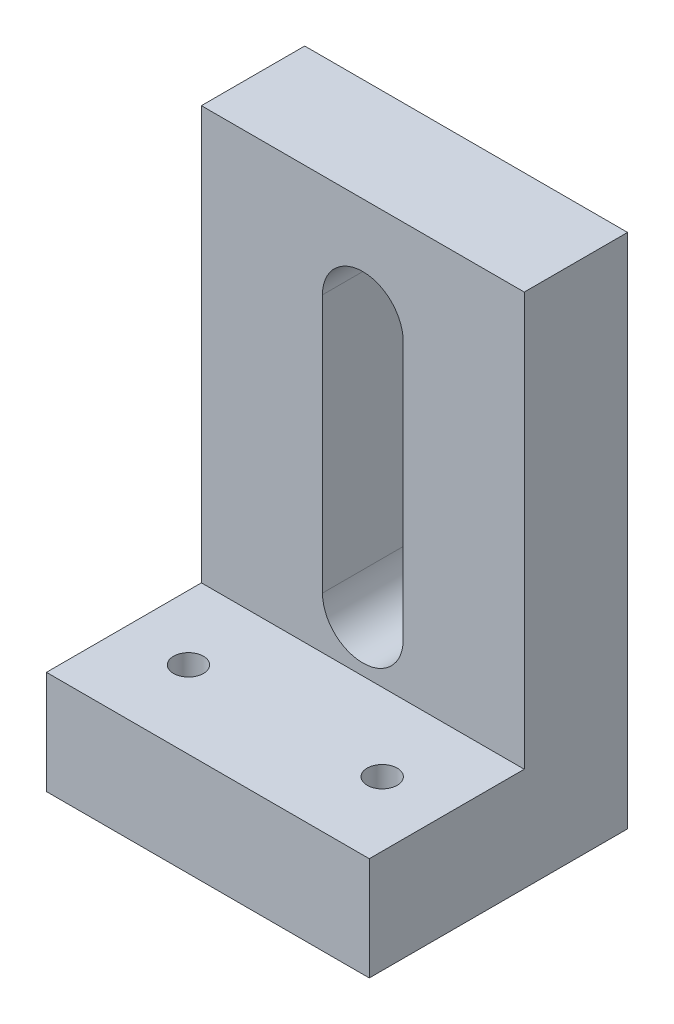
ISO-10303-21;
HEADER;
FILE_DESCRIPTION(('STEP AP214'),'2;1');
FILE_NAME('part.step','',(''),(''),'','','');
FILE_SCHEMA(('AUTOMOTIVE_DESIGN { 1 0 10303 214 1 1 1 1 }'));
ENDSEC;
DATA;
#1=APPLICATION_CONTEXT('core data for automotive mechanical design processes');
#2=APPLICATION_PROTOCOL_DEFINITION('international standard','automotive_design',2000,#1);
#3=PRODUCT_CONTEXT('',#1,'mechanical');
#4=PRODUCT('Part','Part','',(#3));
#5=PRODUCT_RELATED_PRODUCT_CATEGORY('part','',(#4));
#6=PRODUCT_DEFINITION_FORMATION('','',#4);
#7=PRODUCT_DEFINITION_CONTEXT('part definition',#1,'design');
#8=PRODUCT_DEFINITION('design','',#6,#7);
#9=PRODUCT_DEFINITION_SHAPE('','',#8);
#10=(LENGTH_UNIT() NAMED_UNIT(*) SI_UNIT(.MILLI.,.METRE.));
#11=(NAMED_UNIT(*) PLANE_ANGLE_UNIT() SI_UNIT($,.RADIAN.));
#12=(NAMED_UNIT(*) SI_UNIT($,.STERADIAN.) SOLID_ANGLE_UNIT());
#13=UNCERTAINTY_MEASURE_WITH_UNIT(LENGTH_MEASURE(1.E-05),#10,'distance_accuracy_value','');
#14=(GEOMETRIC_REPRESENTATION_CONTEXT(3) GLOBAL_UNCERTAINTY_ASSIGNED_CONTEXT((#13)) GLOBAL_UNIT_ASSIGNED_CONTEXT((#10,
#11,#12)) REPRESENTATION_CONTEXT('',''));
#15=CARTESIAN_POINT('',(0.,0.,0.));
#16=DIRECTION('',(0.,0.,1.));
#17=DIRECTION('',(1.,0.,0.));
#18=AXIS2_PLACEMENT_3D('',#15,#16,#17);
#19=CARTESIAN_POINT('',(-31.75,50.8,-15.24));
#20=DIRECTION('',(0.,0.,1.));
#21=DIRECTION('',(0.,-1.,0.));
#22=AXIS2_PLACEMENT_3D('',#19,#20,#21);
#23=PLANE('',#22);
#24=DIRECTION('',(0.,-1.,0.));
#25=VECTOR('',#24,1.);
#26=CARTESIAN_POINT('',(0.,50.8,-15.24));
#27=LINE('',#26,#25);
#28=CARTESIAN_POINT('',(0.,50.8,-15.24));
#29=VERTEX_POINT('',#28);
#30=CARTESIAN_POINT('',(0.,10.16,-15.24));
#31=VERTEX_POINT('',#30);
#32=EDGE_CURVE('E180',#29,#31,#27,.T.);
#33=ORIENTED_EDGE('',*,*,#32,.F.);
#34=DIRECTION('',(1.,0.,0.));
#35=VECTOR('',#34,1.);
#36=CARTESIAN_POINT('',(-31.75,50.8,-15.24));
#37=LINE('',#36,#35);
#38=CARTESIAN_POINT('',(-31.75,50.8,-15.24));
#39=VERTEX_POINT('',#38);
#40=EDGE_CURVE('E186',#39,#29,#37,.T.);
#41=ORIENTED_EDGE('',*,*,#40,.F.);
#42=DIRECTION('',(0.,-1.,0.));
#43=VECTOR('',#42,1.);
#44=CARTESIAN_POINT('',(-31.75,50.8,-15.24));
#45=LINE('',#44,#43);
#46=CARTESIAN_POINT('',(-31.75,10.16,-15.24));
#47=VERTEX_POINT('',#46);
#48=EDGE_CURVE('E163',#39,#47,#45,.T.);
#49=ORIENTED_EDGE('',*,*,#48,.T.);
#50=DIRECTION('',(1.,0.,0.));
#51=VECTOR('',#50,1.);
#52=CARTESIAN_POINT('',(-31.75,10.16,-15.24));
#53=LINE('',#52,#51);
#54=EDGE_CURVE('E41',#47,#31,#53,.T.);
#55=ORIENTED_EDGE('',*,*,#54,.T.);
#56=EDGE_LOOP('',(#33,#41,#49,#55));
#57=FACE_BOUND('',#56,.T.);
#58=CARTESIAN_POINT('',(-15.875,40.64,-15.24));
#59=DIRECTION('',(0.,0.,1.));
#60=DIRECTION('',(1.,0.,0.));
#61=AXIS2_PLACEMENT_3D('',#58,#59,#60);
#62=CIRCLE('',#61,3.96875);
#63=CARTESIAN_POINT('',(-11.90625,40.64,-15.24));
#64=VERTEX_POINT('',#63);
#65=CARTESIAN_POINT('',(-19.84375,40.64,-15.24));
#66=VERTEX_POINT('',#65);
#67=EDGE_CURVE('E139',#64,#66,#62,.T.);
#68=ORIENTED_EDGE('',*,*,#67,.F.);
#69=DIRECTION('',(0.,-1.,0.));
#70=VECTOR('',#69,1.);
#71=CARTESIAN_POINT('',(-11.90625,0.,-15.24));
#72=LINE('',#71,#70);
#73=CARTESIAN_POINT('',(-11.90625,15.24,-15.24));
#74=VERTEX_POINT('',#73);
#75=EDGE_CURVE('E49',#64,#74,#72,.T.);
#76=ORIENTED_EDGE('',*,*,#75,.T.);
#77=CARTESIAN_POINT('',(-15.875,15.24,-15.24));
#78=DIRECTION('',(0.,0.,1.));
#79=DIRECTION('',(1.,0.,0.));
#80=AXIS2_PLACEMENT_3D('',#77,#78,#79);
#81=CIRCLE('',#80,3.96875);
#82=CARTESIAN_POINT('',(-19.84375,15.24,-15.24));
#83=VERTEX_POINT('',#82);
#84=EDGE_CURVE('E127',#83,#74,#81,.T.);
#85=ORIENTED_EDGE('',*,*,#84,.F.);
#86=DIRECTION('',(0.,-1.,0.));
#87=VECTOR('',#86,1.);
#88=CARTESIAN_POINT('',(-19.84375,0.,-15.24));
#89=LINE('',#88,#87);
#90=EDGE_CURVE('E130',#66,#83,#89,.T.);
#91=ORIENTED_EDGE('',*,*,#90,.F.);
#92=EDGE_LOOP('',(#68,#76,#85,#91));
#93=FACE_BOUND('',#92,.T.);
#94=ADVANCED_FACE('F32',(#57,#93),#23,.T.);
#95=CARTESIAN_POINT('',(-31.75,0.,-25.4));
#96=DIRECTION('',(0.,0.,-1.));
#97=DIRECTION('',(-1.,0.,0.));
#98=AXIS2_PLACEMENT_3D('',#95,#96,#97);
#99=PLANE('',#98);
#100=DIRECTION('',(0.,1.,0.));
#101=VECTOR('',#100,1.);
#102=CARTESIAN_POINT('',(0.,0.,-25.4));
#103=LINE('',#102,#101);
#104=CARTESIAN_POINT('',(0.,0.,-25.4));
#105=VERTEX_POINT('',#104);
#106=CARTESIAN_POINT('',(0.,50.8,-25.4));
#107=VERTEX_POINT('',#106);
#108=EDGE_CURVE('E174',#105,#107,#103,.T.);
#109=ORIENTED_EDGE('',*,*,#108,.F.);
#110=DIRECTION('',(1.,0.,0.));
#111=VECTOR('',#110,1.);
#112=CARTESIAN_POINT('',(-31.75,0.,-25.4));
#113=LINE('',#112,#111);
#114=CARTESIAN_POINT('',(-31.75,0.,-25.4));
#115=VERTEX_POINT('',#114);
#116=EDGE_CURVE('E189',#115,#105,#113,.T.);
#117=ORIENTED_EDGE('',*,*,#116,.F.);
#118=DIRECTION('',(0.,1.,0.));
#119=VECTOR('',#118,1.);
#120=CARTESIAN_POINT('',(-31.75,0.,-25.4));
#121=LINE('',#120,#119);
#122=CARTESIAN_POINT('',(-31.75,50.8,-25.4));
#123=VERTEX_POINT('',#122);
#124=EDGE_CURVE('E157',#115,#123,#121,.T.);
#125=ORIENTED_EDGE('',*,*,#124,.T.);
#126=DIRECTION('',(1.,0.,0.));
#127=VECTOR('',#126,1.);
#128=CARTESIAN_POINT('',(-31.75,50.8,-25.4));
#129=LINE('',#128,#127);
#130=EDGE_CURVE('E188',#123,#107,#129,.T.);
#131=ORIENTED_EDGE('',*,*,#130,.T.);
#132=EDGE_LOOP('',(#109,#117,#125,#131));
#133=FACE_BOUND('',#132,.T.);
#134=CARTESIAN_POINT('',(-15.875,15.24,-25.4));
#135=DIRECTION('',(0.,0.,1.));
#136=DIRECTION('',(1.,0.,0.));
#137=AXIS2_PLACEMENT_3D('',#134,#135,#136);
#138=CIRCLE('',#137,3.96875);
#139=CARTESIAN_POINT('',(-19.84375,15.24,-25.4));
#140=VERTEX_POINT('',#139);
#141=CARTESIAN_POINT('',(-11.90625,15.24,-25.4));
#142=VERTEX_POINT('',#141);
#143=EDGE_CURVE('E117',#140,#142,#138,.T.);
#144=ORIENTED_EDGE('',*,*,#143,.T.);
#145=DIRECTION('',(0.,-1.,0.));
#146=VECTOR('',#145,1.);
#147=CARTESIAN_POINT('',(-11.90625,0.,-25.4));
#148=LINE('',#147,#146);
#149=CARTESIAN_POINT('',(-11.90625,40.64,-25.4));
#150=VERTEX_POINT('',#149);
#151=EDGE_CURVE('E111',#150,#142,#148,.T.);
#152=ORIENTED_EDGE('',*,*,#151,.F.);
#153=CARTESIAN_POINT('',(-15.875,40.64,-25.4));
#154=DIRECTION('',(0.,0.,1.));
#155=DIRECTION('',(1.,0.,0.));
#156=AXIS2_PLACEMENT_3D('',#153,#154,#155);
#157=CIRCLE('',#156,3.96875);
#158=CARTESIAN_POINT('',(-19.84375,40.64,-25.4));
#159=VERTEX_POINT('',#158);
#160=EDGE_CURVE('E120',#150,#159,#157,.T.);
#161=ORIENTED_EDGE('',*,*,#160,.T.);
#162=DIRECTION('',(0.,-1.,0.));
#163=VECTOR('',#162,1.);
#164=CARTESIAN_POINT('',(-19.84375,0.,-25.4));
#165=LINE('',#164,#163);
#166=EDGE_CURVE('E57',#159,#140,#165,.T.);
#167=ORIENTED_EDGE('',*,*,#166,.T.);
#168=EDGE_LOOP('',(#144,#152,#161,#167));
#169=FACE_BOUND('',#168,.T.);
#170=ADVANCED_FACE('F125',(#133,#169),#99,.T.);
#171=CARTESIAN_POINT('',(-31.75,10.16,0.));
#172=DIRECTION('',(0.,0.,1.));
#173=DIRECTION('',(1.,0.,0.));
#174=AXIS2_PLACEMENT_3D('',#171,#172,#173);
#175=PLANE('',#174);
#176=DIRECTION('',(0.,-1.,0.));
#177=VECTOR('',#176,1.);
#178=CARTESIAN_POINT('',(0.,10.16,0.));
#179=LINE('',#178,#177);
#180=CARTESIAN_POINT('',(0.,10.16,0.));
#181=VERTEX_POINT('',#180);
#182=CARTESIAN_POINT('',(0.,0.,0.));
#183=VERTEX_POINT('',#182);
#184=EDGE_CURVE('E146',#181,#183,#179,.T.);
#185=ORIENTED_EDGE('',*,*,#184,.F.);
#186=DIRECTION('',(1.,0.,0.));
#187=VECTOR('',#186,1.);
#188=CARTESIAN_POINT('',(-31.75,10.16,0.));
#189=LINE('',#188,#187);
#190=CARTESIAN_POINT('',(-31.75,10.16,0.));
#191=VERTEX_POINT('',#190);
#192=EDGE_CURVE('E11',#191,#181,#189,.T.);
#193=ORIENTED_EDGE('',*,*,#192,.F.);
#194=DIRECTION('',(0.,-1.,0.));
#195=VECTOR('',#194,1.);
#196=CARTESIAN_POINT('',(-31.75,10.16,0.));
#197=LINE('',#196,#195);
#198=CARTESIAN_POINT('',(-31.75,0.,0.));
#199=VERTEX_POINT('',#198);
#200=EDGE_CURVE('E150',#191,#199,#197,.T.);
#201=ORIENTED_EDGE('',*,*,#200,.T.);
#202=DIRECTION('',(1.,0.,0.));
#203=VECTOR('',#202,1.);
#204=CARTESIAN_POINT('',(-31.75,0.,0.));
#205=LINE('',#204,#203);
#206=EDGE_CURVE('E36',#199,#183,#205,.T.);
#207=ORIENTED_EDGE('',*,*,#206,.T.);
#208=EDGE_LOOP('',(#185,#193,#201,#207));
#209=FACE_BOUND('',#208,.T.);
#210=ADVANCED_FACE('F34',(#209),#175,.T.);
#211=CARTESIAN_POINT('',(-31.75,10.16,-15.24));
#212=DIRECTION('',(0.,1.,0.));
#213=DIRECTION('',(0.,0.,1.));
#214=AXIS2_PLACEMENT_3D('',#211,#212,#213);
#215=PLANE('',#214);
#216=CARTESIAN_POINT('',(-25.4,10.16,-7.62));
#217=DIRECTION('',(0.,1.,0.));
#218=DIRECTION('',(0.,0.,1.));
#219=AXIS2_PLACEMENT_3D('',#216,#217,#218);
#220=CIRCLE('',#219,1.4732);
#221=CARTESIAN_POINT('',(-25.4,10.16,-6.1468));
#222=VERTEX_POINT('',#221);
#223=EDGE_CURVE('E258',#222,#222,#220,.T.);
#224=ORIENTED_EDGE('',*,*,#223,.F.);
#225=EDGE_LOOP('',(#224));
#226=FACE_BOUND('',#225,.T.);
#227=CARTESIAN_POINT('',(-6.35,10.16,-7.62));
#228=DIRECTION('',(0.,1.,0.));
#229=DIRECTION('',(0.,0.,1.));
#230=AXIS2_PLACEMENT_3D('',#227,#228,#229);
#231=CIRCLE('',#230,1.4732);
#232=CARTESIAN_POINT('',(-6.35,10.16,-6.1468));
#233=VERTEX_POINT('',#232);
#234=EDGE_CURVE('E133',#233,#233,#231,.T.);
#235=ORIENTED_EDGE('',*,*,#234,.F.);
#236=EDGE_LOOP('',(#235));
#237=FACE_BOUND('',#236,.T.);
#238=DIRECTION('',(0.,0.,1.));
#239=VECTOR('',#238,1.);
#240=CARTESIAN_POINT('',(0.,10.16,-15.24));
#241=LINE('',#240,#239);
#242=EDGE_CURVE('E154',#31,#181,#241,.T.);
#243=ORIENTED_EDGE('',*,*,#242,.F.);
#244=ORIENTED_EDGE('',*,*,#54,.F.);
#245=DIRECTION('',(0.,0.,1.));
#246=VECTOR('',#245,1.);
#247=CARTESIAN_POINT('',(-31.75,10.16,-15.24));
#248=LINE('',#247,#246);
#249=EDGE_CURVE('E166',#47,#191,#248,.T.);
#250=ORIENTED_EDGE('',*,*,#249,.T.);
#251=ORIENTED_EDGE('',*,*,#192,.T.);
#252=EDGE_LOOP('',(#243,#244,#250,#251));
#253=FACE_BOUND('',#252,.T.);
#254=ADVANCED_FACE('F203',(#226,#237,#253),#215,.T.);
#255=CARTESIAN_POINT('',(-31.75,50.8,-25.4));
#256=DIRECTION('',(0.,1.,0.));
#257=DIRECTION('',(0.,0.,1.));
#258=AXIS2_PLACEMENT_3D('',#255,#256,#257);
#259=PLANE('',#258);
#260=DIRECTION('',(0.,0.,1.));
#261=VECTOR('',#260,1.);
#262=CARTESIAN_POINT('',(0.,50.8,-25.4));
#263=LINE('',#262,#261);
#264=EDGE_CURVE('E177',#107,#29,#263,.T.);
#265=ORIENTED_EDGE('',*,*,#264,.F.);
#266=ORIENTED_EDGE('',*,*,#130,.F.);
#267=DIRECTION('',(0.,0.,1.));
#268=VECTOR('',#267,1.);
#269=CARTESIAN_POINT('',(-31.75,50.8,-25.4));
#270=LINE('',#269,#268);
#271=EDGE_CURVE('E160',#123,#39,#270,.T.);
#272=ORIENTED_EDGE('',*,*,#271,.T.);
#273=ORIENTED_EDGE('',*,*,#40,.T.);
#274=EDGE_LOOP('',(#265,#266,#272,#273));
#275=FACE_BOUND('',#274,.T.);
#276=ADVANCED_FACE('F213',(#275),#259,.T.);
#277=CARTESIAN_POINT('',(-31.75,0.,0.));
#278=DIRECTION('',(0.,-1.,0.));
#279=DIRECTION('',(0.,0.,-1.));
#280=AXIS2_PLACEMENT_3D('',#277,#278,#279);
#281=PLANE('',#280);
#282=CARTESIAN_POINT('',(-25.4,0.,-7.62));
#283=DIRECTION('',(0.,1.,0.));
#284=DIRECTION('',(0.,0.,1.));
#285=AXIS2_PLACEMENT_3D('',#282,#283,#284);
#286=CIRCLE('',#285,1.4732);
#287=CARTESIAN_POINT('',(-25.4,0.,-6.1468));
#288=VERTEX_POINT('',#287);
#289=EDGE_CURVE('E140',#288,#288,#286,.T.);
#290=ORIENTED_EDGE('',*,*,#289,.T.);
#291=EDGE_LOOP('',(#290));
#292=FACE_BOUND('',#291,.T.);
#293=CARTESIAN_POINT('',(-6.35,0.,-7.62));
#294=DIRECTION('',(0.,1.,0.));
#295=DIRECTION('',(0.,0.,1.));
#296=AXIS2_PLACEMENT_3D('',#293,#294,#295);
#297=CIRCLE('',#296,1.4732);
#298=CARTESIAN_POINT('',(-6.35,0.,-6.1468));
#299=VERTEX_POINT('',#298);
#300=EDGE_CURVE('E256',#299,#299,#297,.T.);
#301=ORIENTED_EDGE('',*,*,#300,.T.);
#302=EDGE_LOOP('',(#301));
#303=FACE_BOUND('',#302,.T.);
#304=DIRECTION('',(0.,0.,-1.));
#305=VECTOR('',#304,1.);
#306=CARTESIAN_POINT('',(0.,0.,0.));
#307=LINE('',#306,#305);
#308=EDGE_CURVE('E171',#183,#105,#307,.T.);
#309=ORIENTED_EDGE('',*,*,#308,.F.);
#310=ORIENTED_EDGE('',*,*,#206,.F.);
#311=DIRECTION('',(0.,0.,-1.));
#312=VECTOR('',#311,1.);
#313=CARTESIAN_POINT('',(-31.75,0.,0.));
#314=LINE('',#313,#312);
#315=EDGE_CURVE('E153',#199,#115,#314,.T.);
#316=ORIENTED_EDGE('',*,*,#315,.T.);
#317=ORIENTED_EDGE('',*,*,#116,.T.);
#318=EDGE_LOOP('',(#309,#310,#316,#317));
#319=FACE_BOUND('',#318,.T.);
#320=ADVANCED_FACE('F197',(#292,#303,#319),#281,.T.);
#321=CARTESIAN_POINT('',(-31.75,0.,0.));
#322=DIRECTION('',(1.,0.,0.));
#323=DIRECTION('',(0.,0.,-1.));
#324=AXIS2_PLACEMENT_3D('',#321,#322,#323);
#325=PLANE('',#324);
#326=ORIENTED_EDGE('',*,*,#200,.F.);
#327=ORIENTED_EDGE('',*,*,#249,.F.);
#328=ORIENTED_EDGE('',*,*,#48,.F.);
#329=ORIENTED_EDGE('',*,*,#271,.F.);
#330=ORIENTED_EDGE('',*,*,#124,.F.);
#331=ORIENTED_EDGE('',*,*,#315,.F.);
#332=EDGE_LOOP('',(#326,#327,#328,#329,#330,#331));
#333=FACE_BOUND('',#332,.T.);
#334=ADVANCED_FACE('F206',(#333),#325,.F.);
#335=CARTESIAN_POINT('',(0.,0.,0.));
#336=DIRECTION('',(1.,0.,0.));
#337=DIRECTION('',(0.,0.,-1.));
#338=AXIS2_PLACEMENT_3D('',#335,#336,#337);
#339=PLANE('',#338);
#340=ORIENTED_EDGE('',*,*,#184,.T.);
#341=ORIENTED_EDGE('',*,*,#308,.T.);
#342=ORIENTED_EDGE('',*,*,#108,.T.);
#343=ORIENTED_EDGE('',*,*,#264,.T.);
#344=ORIENTED_EDGE('',*,*,#32,.T.);
#345=ORIENTED_EDGE('',*,*,#242,.T.);
#346=EDGE_LOOP('',(#340,#341,#342,#343,#344,#345));
#347=FACE_BOUND('',#346,.T.);
#348=ADVANCED_FACE('F199',(#347),#339,.T.);
#349=CARTESIAN_POINT('',(-11.90625,0.,-25.4));
#350=DIRECTION('',(-1.,0.,0.));
#351=DIRECTION('',(0.,-1.,0.));
#352=AXIS2_PLACEMENT_3D('',#349,#350,#351);
#353=PLANE('',#352);
#354=ORIENTED_EDGE('',*,*,#75,.F.);
#355=DIRECTION('',(0.,0.,1.));
#356=VECTOR('',#355,1.);
#357=CARTESIAN_POINT('',(-11.90625,40.64,-25.4));
#358=LINE('',#357,#356);
#359=EDGE_CURVE('E107',#150,#64,#358,.T.);
#360=ORIENTED_EDGE('',*,*,#359,.F.);
#361=ORIENTED_EDGE('',*,*,#151,.T.);
#362=DIRECTION('',(0.,0.,1.));
#363=VECTOR('',#362,1.);
#364=CARTESIAN_POINT('',(-11.90625,15.24,-25.4));
#365=LINE('',#364,#363);
#366=EDGE_CURVE('E144',#142,#74,#365,.T.);
#367=ORIENTED_EDGE('',*,*,#366,.T.);
#368=EDGE_LOOP('',(#354,#360,#361,#367));
#369=FACE_BOUND('',#368,.T.);
#370=ADVANCED_FACE('F109',(#369),#353,.T.);
#371=CARTESIAN_POINT('',(-15.875,15.24,-25.4));
#372=DIRECTION('',(0.,0.,1.));
#373=DIRECTION('',(1.,0.,0.));
#374=AXIS2_PLACEMENT_3D('',#371,#372,#373);
#375=CYLINDRICAL_SURFACE('',#374,3.96875);
#376=ORIENTED_EDGE('',*,*,#84,.T.);
#377=ORIENTED_EDGE('',*,*,#366,.F.);
#378=ORIENTED_EDGE('',*,*,#143,.F.);
#379=DIRECTION('',(0.,0.,1.));
#380=VECTOR('',#379,1.);
#381=CARTESIAN_POINT('',(-19.84375,15.24,-25.4));
#382=LINE('',#381,#380);
#383=EDGE_CURVE('E147',#140,#83,#382,.T.);
#384=ORIENTED_EDGE('',*,*,#383,.T.);
#385=EDGE_LOOP('',(#376,#377,#378,#384));
#386=FACE_BOUND('',#385,.T.);
#387=ADVANCED_FACE('F222',(#386),#375,.F.);
#388=CARTESIAN_POINT('',(-19.84375,0.,-25.4));
#389=DIRECTION('',(-1.,0.,0.));
#390=DIRECTION('',(0.,-1.,0.));
#391=AXIS2_PLACEMENT_3D('',#388,#389,#390);
#392=PLANE('',#391);
#393=ORIENTED_EDGE('',*,*,#90,.T.);
#394=ORIENTED_EDGE('',*,*,#383,.F.);
#395=ORIENTED_EDGE('',*,*,#166,.F.);
#396=DIRECTION('',(0.,0.,1.));
#397=VECTOR('',#396,1.);
#398=CARTESIAN_POINT('',(-19.84375,40.64,-25.4));
#399=LINE('',#398,#397);
#400=EDGE_CURVE('E116',#159,#66,#399,.T.);
#401=ORIENTED_EDGE('',*,*,#400,.T.);
#402=EDGE_LOOP('',(#393,#394,#395,#401));
#403=FACE_BOUND('',#402,.T.);
#404=ADVANCED_FACE('F220',(#403),#392,.F.);
#405=CARTESIAN_POINT('',(-15.875,40.64,-25.4));
#406=DIRECTION('',(0.,0.,1.));
#407=DIRECTION('',(1.,0.,0.));
#408=AXIS2_PLACEMENT_3D('',#405,#406,#407);
#409=CYLINDRICAL_SURFACE('',#408,3.96875);
#410=ORIENTED_EDGE('',*,*,#67,.T.);
#411=ORIENTED_EDGE('',*,*,#400,.F.);
#412=ORIENTED_EDGE('',*,*,#160,.F.);
#413=ORIENTED_EDGE('',*,*,#359,.T.);
#414=EDGE_LOOP('',(#410,#411,#412,#413));
#415=FACE_BOUND('',#414,.T.);
#416=ADVANCED_FACE('F121',(#415),#409,.F.);
#417=CARTESIAN_POINT('',(-6.35,0.,-7.62));
#418=DIRECTION('',(0.,1.,0.));
#419=DIRECTION('',(0.,0.,1.));
#420=AXIS2_PLACEMENT_3D('',#417,#418,#419);
#421=CYLINDRICAL_SURFACE('',#420,1.4732);
#422=ORIENTED_EDGE('',*,*,#300,.F.);
#423=EDGE_LOOP('',(#422));
#424=FACE_BOUND('',#423,.T.);
#425=ORIENTED_EDGE('',*,*,#234,.T.);
#426=EDGE_LOOP('',(#425));
#427=FACE_BOUND('',#426,.T.);
#428=ADVANCED_FACE('F232',(#424,#427),#421,.F.);
#429=CARTESIAN_POINT('',(-25.4,0.,-7.62));
#430=DIRECTION('',(0.,1.,0.));
#431=DIRECTION('',(0.,0.,1.));
#432=AXIS2_PLACEMENT_3D('',#429,#430,#431);
#433=CYLINDRICAL_SURFACE('',#432,1.4732);
#434=ORIENTED_EDGE('',*,*,#289,.F.);
#435=EDGE_LOOP('',(#434));
#436=FACE_BOUND('',#435,.T.);
#437=ORIENTED_EDGE('',*,*,#223,.T.);
#438=EDGE_LOOP('',(#437));
#439=FACE_BOUND('',#438,.T.);
#440=ADVANCED_FACE('F267',(#436,#439),#433,.F.);
#441=CLOSED_SHELL('',(#94,#170,#210,#254,#276,#320,#334,#348,#370,#387,#404,#416,#428,#440));
#442=MANIFOLD_SOLID_BREP('B2',#441);
#443=ADVANCED_BREP_SHAPE_REPRESENTATION('',(#18,#442),#14);
#444=SHAPE_DEFINITION_REPRESENTATION(#9,#443);
ENDSEC;
END-ISO-10303-21;
